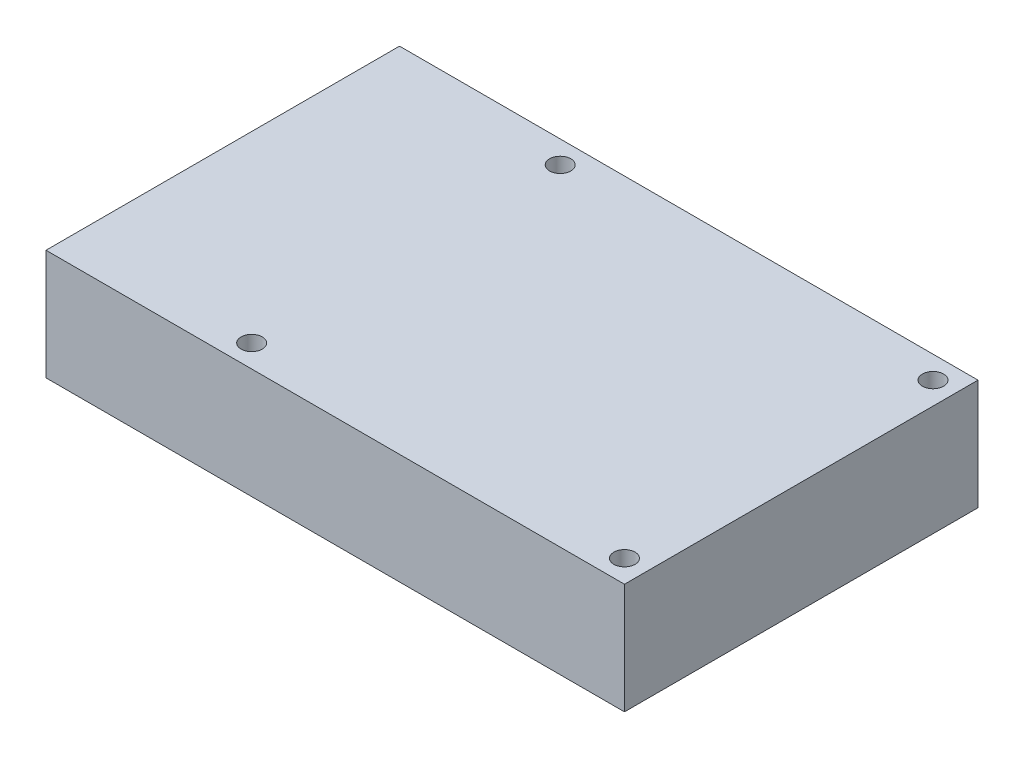
ISO-10303-21;
HEADER;
FILE_DESCRIPTION(('STEP AP214'),'2;1');
FILE_NAME('part.step','',(''),(''),'','','');
FILE_SCHEMA(('AUTOMOTIVE_DESIGN { 1 0 10303 214 1 1 1 1 }'));
ENDSEC;
DATA;
#1=APPLICATION_CONTEXT('core data for automotive mechanical design processes');
#2=APPLICATION_PROTOCOL_DEFINITION('international standard','automotive_design',2000,#1);
#3=PRODUCT_CONTEXT('',#1,'mechanical');
#4=PRODUCT('Part','Part','',(#3));
#5=PRODUCT_RELATED_PRODUCT_CATEGORY('part','',(#4));
#6=PRODUCT_DEFINITION_FORMATION('','',#4);
#7=PRODUCT_DEFINITION_CONTEXT('part definition',#1,'design');
#8=PRODUCT_DEFINITION('design','',#6,#7);
#9=PRODUCT_DEFINITION_SHAPE('','',#8);
#10=(LENGTH_UNIT() NAMED_UNIT(*) SI_UNIT(.MILLI.,.METRE.));
#11=(NAMED_UNIT(*) PLANE_ANGLE_UNIT() SI_UNIT($,.RADIAN.));
#12=(NAMED_UNIT(*) SI_UNIT($,.STERADIAN.) SOLID_ANGLE_UNIT());
#13=UNCERTAINTY_MEASURE_WITH_UNIT(LENGTH_MEASURE(1.E-05),#10,'distance_accuracy_value','');
#14=(GEOMETRIC_REPRESENTATION_CONTEXT(3) GLOBAL_UNCERTAINTY_ASSIGNED_CONTEXT((#13)) GLOBAL_UNIT_ASSIGNED_CONTEXT((#10,
#11,#12)) REPRESENTATION_CONTEXT('',''));
#15=CARTESIAN_POINT('',(0.,0.,0.));
#16=DIRECTION('',(0.,0.,1.));
#17=DIRECTION('',(1.,0.,0.));
#18=AXIS2_PLACEMENT_3D('',#15,#16,#17);
#19=CARTESIAN_POINT('',(45.,17.2,27.5));
#20=DIRECTION('',(-1.,0.,0.));
#21=DIRECTION('',(0.,0.,1.));
#22=AXIS2_PLACEMENT_3D('',#19,#20,#21);
#23=PLANE('',#22);
#24=DIRECTION('',(0.,0.,-1.));
#25=VECTOR('',#24,1.);
#26=CARTESIAN_POINT('',(45.,0.,27.5));
#27=LINE('',#26,#25);
#28=CARTESIAN_POINT('',(45.,0.,27.5));
#29=VERTEX_POINT('',#28);
#30=CARTESIAN_POINT('',(45.,0.,-27.5));
#31=VERTEX_POINT('',#30);
#32=EDGE_CURVE('E95',#29,#31,#27,.T.);
#33=ORIENTED_EDGE('',*,*,#32,.T.);
#34=DIRECTION('',(0.,-1.,0.));
#35=VECTOR('',#34,1.);
#36=CARTESIAN_POINT('',(45.,17.2,-27.5));
#37=LINE('',#36,#35);
#38=CARTESIAN_POINT('',(45.,17.2,-27.5));
#39=VERTEX_POINT('',#38);
#40=EDGE_CURVE('E11',#39,#31,#37,.T.);
#41=ORIENTED_EDGE('',*,*,#40,.F.);
#42=DIRECTION('',(0.,0.,-1.));
#43=VECTOR('',#42,1.);
#44=CARTESIAN_POINT('',(45.,17.2,27.5));
#45=LINE('',#44,#43);
#46=CARTESIAN_POINT('',(45.,17.2,27.5));
#47=VERTEX_POINT('',#46);
#48=EDGE_CURVE('E83',#47,#39,#45,.T.);
#49=ORIENTED_EDGE('',*,*,#48,.F.);
#50=DIRECTION('',(0.,-1.,0.));
#51=VECTOR('',#50,1.);
#52=CARTESIAN_POINT('',(45.,17.2,27.5));
#53=LINE('',#52,#51);
#54=EDGE_CURVE('E91',#47,#29,#53,.T.);
#55=ORIENTED_EDGE('',*,*,#54,.T.);
#56=EDGE_LOOP('',(#33,#41,#49,#55));
#57=FACE_BOUND('',#56,.T.);
#58=ADVANCED_FACE('F32',(#57),#23,.F.);
#59=CARTESIAN_POINT('',(-45.,17.2,-27.5));
#60=DIRECTION('',(0.,0.,1.));
#61=DIRECTION('',(1.,0.,0.));
#62=AXIS2_PLACEMENT_3D('',#59,#60,#61);
#63=PLANE('',#62);
#64=DIRECTION('',(-1.,0.,0.));
#65=VECTOR('',#64,1.);
#66=CARTESIAN_POINT('',(-45.,0.,-27.5));
#67=LINE('',#66,#65);
#68=CARTESIAN_POINT('',(-45.,0.,-27.5));
#69=VERTEX_POINT('',#68);
#70=EDGE_CURVE('E87',#31,#69,#67,.T.);
#71=ORIENTED_EDGE('',*,*,#70,.T.);
#72=DIRECTION('',(0.,-1.,0.));
#73=VECTOR('',#72,1.);
#74=CARTESIAN_POINT('',(-45.,17.2,-27.5));
#75=LINE('',#74,#73);
#76=CARTESIAN_POINT('',(-45.,17.2,-27.5));
#77=VERTEX_POINT('',#76);
#78=EDGE_CURVE('E40',#77,#69,#75,.T.);
#79=ORIENTED_EDGE('',*,*,#78,.F.);
#80=DIRECTION('',(-1.,0.,0.));
#81=VECTOR('',#80,1.);
#82=CARTESIAN_POINT('',(-45.,17.2,-27.5));
#83=LINE('',#82,#81);
#84=EDGE_CURVE('E78',#39,#77,#83,.T.);
#85=ORIENTED_EDGE('',*,*,#84,.F.);
#86=ORIENTED_EDGE('',*,*,#40,.T.);
#87=EDGE_LOOP('',(#71,#79,#85,#86));
#88=FACE_BOUND('',#87,.T.);
#89=ADVANCED_FACE('F86',(#88),#63,.F.);
#90=CARTESIAN_POINT('',(-45.,17.2,27.5));
#91=DIRECTION('',(1.,0.,0.));
#92=DIRECTION('',(0.,0.,-1.));
#93=AXIS2_PLACEMENT_3D('',#90,#91,#92);
#94=PLANE('',#93);
#95=DIRECTION('',(0.,0.,1.));
#96=VECTOR('',#95,1.);
#97=CARTESIAN_POINT('',(-45.,0.,27.5));
#98=LINE('',#97,#96);
#99=CARTESIAN_POINT('',(-45.,0.,27.5));
#100=VERTEX_POINT('',#99);
#101=EDGE_CURVE('E65',#69,#100,#98,.T.);
#102=ORIENTED_EDGE('',*,*,#101,.T.);
#103=DIRECTION('',(0.,-1.,0.));
#104=VECTOR('',#103,1.);
#105=CARTESIAN_POINT('',(-45.,17.2,27.5));
#106=LINE('',#105,#104);
#107=CARTESIAN_POINT('',(-45.,17.2,27.5));
#108=VERTEX_POINT('',#107);
#109=EDGE_CURVE('E88',#108,#100,#106,.T.);
#110=ORIENTED_EDGE('',*,*,#109,.F.);
#111=DIRECTION('',(0.,0.,1.));
#112=VECTOR('',#111,1.);
#113=CARTESIAN_POINT('',(-45.,17.2,27.5));
#114=LINE('',#113,#112);
#115=EDGE_CURVE('E81',#77,#108,#114,.T.);
#116=ORIENTED_EDGE('',*,*,#115,.F.);
#117=ORIENTED_EDGE('',*,*,#78,.T.);
#118=EDGE_LOOP('',(#102,#110,#116,#117));
#119=FACE_BOUND('',#118,.T.);
#120=ADVANCED_FACE('F89',(#119),#94,.F.);
#121=CARTESIAN_POINT('',(-45.,17.2,27.5));
#122=DIRECTION('',(0.,0.,-1.));
#123=DIRECTION('',(-1.,0.,0.));
#124=AXIS2_PLACEMENT_3D('',#121,#122,#123);
#125=PLANE('',#124);
#126=DIRECTION('',(1.,0.,0.));
#127=VECTOR('',#126,1.);
#128=CARTESIAN_POINT('',(-45.,0.,27.5));
#129=LINE('',#128,#127);
#130=EDGE_CURVE('E71',#100,#29,#129,.T.);
#131=ORIENTED_EDGE('',*,*,#130,.T.);
#132=ORIENTED_EDGE('',*,*,#54,.F.);
#133=DIRECTION('',(1.,0.,0.));
#134=VECTOR('',#133,1.);
#135=CARTESIAN_POINT('',(-45.,17.2,27.5));
#136=LINE('',#135,#134);
#137=EDGE_CURVE('E48',#108,#47,#136,.T.);
#138=ORIENTED_EDGE('',*,*,#137,.F.);
#139=ORIENTED_EDGE('',*,*,#109,.T.);
#140=EDGE_LOOP('',(#131,#132,#138,#139));
#141=FACE_BOUND('',#140,.T.);
#142=ADVANCED_FACE('F103',(#141),#125,.F.);
#143=CARTESIAN_POINT('',(0.,17.2,0.));
#144=DIRECTION('',(0.,-1.,0.));
#145=DIRECTION('',(0.,0.,-1.));
#146=AXIS2_PLACEMENT_3D('',#143,#144,#145);
#147=PLANE('',#146);
#148=CARTESIAN_POINT('',(41.5,17.2,24.));
#149=DIRECTION('',(0.,1.,0.));
#150=DIRECTION('',(0.,0.,1.));
#151=AXIS2_PLACEMENT_3D('',#148,#149,#150);
#152=CIRCLE('',#151,1.65);
#153=CARTESIAN_POINT('',(41.5,17.2,25.65));
#154=VERTEX_POINT('',#153);
#155=EDGE_CURVE('E127',#154,#154,#152,.T.);
#156=ORIENTED_EDGE('',*,*,#155,.F.);
#157=EDGE_LOOP('',(#156));
#158=FACE_BOUND('',#157,.T.);
#159=CARTESIAN_POINT('',(-16.5,17.2,24.));
#160=DIRECTION('',(0.,1.,0.));
#161=DIRECTION('',(0.,0.,1.));
#162=AXIS2_PLACEMENT_3D('',#159,#160,#161);
#163=CIRCLE('',#162,1.65);
#164=CARTESIAN_POINT('',(-16.5,17.2,25.65));
#165=VERTEX_POINT('',#164);
#166=EDGE_CURVE('E121',#165,#165,#163,.T.);
#167=ORIENTED_EDGE('',*,*,#166,.F.);
#168=EDGE_LOOP('',(#167));
#169=FACE_BOUND('',#168,.T.);
#170=CARTESIAN_POINT('',(-16.5,17.2,-24.));
#171=DIRECTION('',(0.,1.,0.));
#172=DIRECTION('',(0.,0.,1.));
#173=AXIS2_PLACEMENT_3D('',#170,#171,#172);
#174=CIRCLE('',#173,1.65);
#175=CARTESIAN_POINT('',(-16.5,17.2,-22.35));
#176=VERTEX_POINT('',#175);
#177=EDGE_CURVE('E115',#176,#176,#174,.T.);
#178=ORIENTED_EDGE('',*,*,#177,.F.);
#179=EDGE_LOOP('',(#178));
#180=FACE_BOUND('',#179,.T.);
#181=CARTESIAN_POINT('',(41.5,17.2,-24.));
#182=DIRECTION('',(0.,1.,0.));
#183=DIRECTION('',(0.,0.,1.));
#184=AXIS2_PLACEMENT_3D('',#181,#182,#183);
#185=CIRCLE('',#184,1.65);
#186=CARTESIAN_POINT('',(41.5,17.2,-22.35));
#187=VERTEX_POINT('',#186);
#188=EDGE_CURVE('E109',#187,#187,#185,.T.);
#189=ORIENTED_EDGE('',*,*,#188,.F.);
#190=EDGE_LOOP('',(#189));
#191=FACE_BOUND('',#190,.T.);
#192=ORIENTED_EDGE('',*,*,#48,.T.);
#193=ORIENTED_EDGE('',*,*,#84,.T.);
#194=ORIENTED_EDGE('',*,*,#115,.T.);
#195=ORIENTED_EDGE('',*,*,#137,.T.);
#196=EDGE_LOOP('',(#192,#193,#194,#195));
#197=FACE_BOUND('',#196,.T.);
#198=ADVANCED_FACE('F79',(#158,#169,#180,#191,#197),#147,.F.);
#199=CARTESIAN_POINT('',(0.,0.,0.));
#200=DIRECTION('',(0.,-1.,0.));
#201=DIRECTION('',(0.,0.,-1.));
#202=AXIS2_PLACEMENT_3D('',#199,#200,#201);
#203=PLANE('',#202);
#204=CARTESIAN_POINT('',(41.5,0.,24.));
#205=DIRECTION('',(0.,1.,0.));
#206=DIRECTION('',(0.,0.,1.));
#207=AXIS2_PLACEMENT_3D('',#204,#205,#206);
#208=CIRCLE('',#207,1.65);
#209=CARTESIAN_POINT('',(41.5,0.,25.65));
#210=VERTEX_POINT('',#209);
#211=EDGE_CURVE('E112',#210,#210,#208,.T.);
#212=ORIENTED_EDGE('',*,*,#211,.T.);
#213=EDGE_LOOP('',(#212));
#214=FACE_BOUND('',#213,.T.);
#215=CARTESIAN_POINT('',(-16.5,0.,24.));
#216=DIRECTION('',(0.,1.,0.));
#217=DIRECTION('',(0.,0.,1.));
#218=AXIS2_PLACEMENT_3D('',#215,#216,#217);
#219=CIRCLE('',#218,1.65);
#220=CARTESIAN_POINT('',(-16.5,0.,25.65));
#221=VERTEX_POINT('',#220);
#222=EDGE_CURVE('E124',#221,#221,#219,.T.);
#223=ORIENTED_EDGE('',*,*,#222,.T.);
#224=EDGE_LOOP('',(#223));
#225=FACE_BOUND('',#224,.T.);
#226=CARTESIAN_POINT('',(-16.5,0.,-24.));
#227=DIRECTION('',(0.,1.,0.));
#228=DIRECTION('',(0.,0.,1.));
#229=AXIS2_PLACEMENT_3D('',#226,#227,#228);
#230=CIRCLE('',#229,1.65);
#231=CARTESIAN_POINT('',(-16.5,0.,-22.35));
#232=VERTEX_POINT('',#231);
#233=EDGE_CURVE('E118',#232,#232,#230,.T.);
#234=ORIENTED_EDGE('',*,*,#233,.T.);
#235=EDGE_LOOP('',(#234));
#236=FACE_BOUND('',#235,.T.);
#237=CARTESIAN_POINT('',(41.5,0.,-24.));
#238=DIRECTION('',(0.,1.,0.));
#239=DIRECTION('',(0.,0.,1.));
#240=AXIS2_PLACEMENT_3D('',#237,#238,#239);
#241=CIRCLE('',#240,1.65);
#242=CARTESIAN_POINT('',(41.5,0.,-22.35));
#243=VERTEX_POINT('',#242);
#244=EDGE_CURVE('E98',#243,#243,#241,.T.);
#245=ORIENTED_EDGE('',*,*,#244,.T.);
#246=EDGE_LOOP('',(#245));
#247=FACE_BOUND('',#246,.T.);
#248=ORIENTED_EDGE('',*,*,#32,.F.);
#249=ORIENTED_EDGE('',*,*,#130,.F.);
#250=ORIENTED_EDGE('',*,*,#101,.F.);
#251=ORIENTED_EDGE('',*,*,#70,.F.);
#252=EDGE_LOOP('',(#248,#249,#250,#251));
#253=FACE_BOUND('',#252,.T.);
#254=ADVANCED_FACE('F106',(#214,#225,#236,#247,#253),#203,.T.);
#255=CARTESIAN_POINT('',(41.5,0.,-24.));
#256=DIRECTION('',(0.,1.,0.));
#257=DIRECTION('',(0.,0.,1.));
#258=AXIS2_PLACEMENT_3D('',#255,#256,#257);
#259=CYLINDRICAL_SURFACE('',#258,1.65);
#260=ORIENTED_EDGE('',*,*,#244,.F.);
#261=EDGE_LOOP('',(#260));
#262=FACE_BOUND('',#261,.T.);
#263=ORIENTED_EDGE('',*,*,#188,.T.);
#264=EDGE_LOOP('',(#263));
#265=FACE_BOUND('',#264,.T.);
#266=ADVANCED_FACE('F151',(#262,#265),#259,.F.);
#267=CARTESIAN_POINT('',(-16.5,0.,-24.));
#268=DIRECTION('',(0.,1.,0.));
#269=DIRECTION('',(0.,0.,1.));
#270=AXIS2_PLACEMENT_3D('',#267,#268,#269);
#271=CYLINDRICAL_SURFACE('',#270,1.65);
#272=ORIENTED_EDGE('',*,*,#233,.F.);
#273=EDGE_LOOP('',(#272));
#274=FACE_BOUND('',#273,.T.);
#275=ORIENTED_EDGE('',*,*,#177,.T.);
#276=EDGE_LOOP('',(#275));
#277=FACE_BOUND('',#276,.T.);
#278=ADVANCED_FACE('F153',(#274,#277),#271,.F.);
#279=CARTESIAN_POINT('',(-16.5,0.,24.));
#280=DIRECTION('',(0.,1.,0.));
#281=DIRECTION('',(0.,0.,1.));
#282=AXIS2_PLACEMENT_3D('',#279,#280,#281);
#283=CYLINDRICAL_SURFACE('',#282,1.65);
#284=ORIENTED_EDGE('',*,*,#222,.F.);
#285=EDGE_LOOP('',(#284));
#286=FACE_BOUND('',#285,.T.);
#287=ORIENTED_EDGE('',*,*,#166,.T.);
#288=EDGE_LOOP('',(#287));
#289=FACE_BOUND('',#288,.T.);
#290=ADVANCED_FACE('F138',(#286,#289),#283,.F.);
#291=CARTESIAN_POINT('',(41.5,0.,24.));
#292=DIRECTION('',(0.,1.,0.));
#293=DIRECTION('',(0.,0.,1.));
#294=AXIS2_PLACEMENT_3D('',#291,#292,#293);
#295=CYLINDRICAL_SURFACE('',#294,1.65);
#296=ORIENTED_EDGE('',*,*,#211,.F.);
#297=EDGE_LOOP('',(#296));
#298=FACE_BOUND('',#297,.T.);
#299=ORIENTED_EDGE('',*,*,#155,.T.);
#300=EDGE_LOOP('',(#299));
#301=FACE_BOUND('',#300,.T.);
#302=ADVANCED_FACE('F135',(#298,#301),#295,.F.);
#303=CLOSED_SHELL('',(#58,#89,#120,#142,#198,#254,#266,#278,#290,#302));
#304=MANIFOLD_SOLID_BREP('B2',#303);
#305=ADVANCED_BREP_SHAPE_REPRESENTATION('',(#18,#304),#14);
#306=SHAPE_DEFINITION_REPRESENTATION(#9,#305);
ENDSEC;
END-ISO-10303-21;
